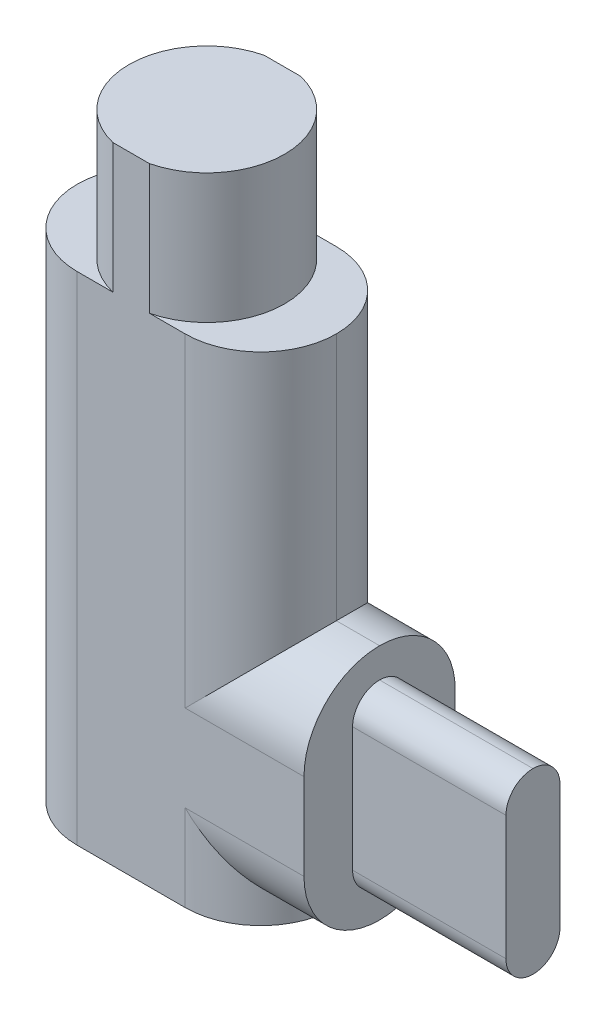
ISO-10303-21;
HEADER;
FILE_DESCRIPTION(('STEP AP214'),'2;1');
FILE_NAME('part.step','',(''),(''),'','','');
FILE_SCHEMA(('AUTOMOTIVE_DESIGN { 1 0 10303 214 1 1 1 1 }'));
ENDSEC;
DATA;
#1=APPLICATION_CONTEXT('core data for automotive mechanical design processes');
#2=APPLICATION_PROTOCOL_DEFINITION('international standard','automotive_design',2000,#1);
#3=PRODUCT_CONTEXT('',#1,'mechanical');
#4=PRODUCT('Part','Part','',(#3));
#5=PRODUCT_RELATED_PRODUCT_CATEGORY('part','',(#4));
#6=PRODUCT_DEFINITION_FORMATION('','',#4);
#7=PRODUCT_DEFINITION_CONTEXT('part definition',#1,'design');
#8=PRODUCT_DEFINITION('design','',#6,#7);
#9=PRODUCT_DEFINITION_SHAPE('','',#8);
#10=(LENGTH_UNIT() NAMED_UNIT(*) SI_UNIT(.MILLI.,.METRE.));
#11=(NAMED_UNIT(*) PLANE_ANGLE_UNIT() SI_UNIT($,.RADIAN.));
#12=(NAMED_UNIT(*) SI_UNIT($,.STERADIAN.) SOLID_ANGLE_UNIT());
#13=UNCERTAINTY_MEASURE_WITH_UNIT(LENGTH_MEASURE(1.E-05),#10,'distance_accuracy_value','');
#14=(GEOMETRIC_REPRESENTATION_CONTEXT(3) GLOBAL_UNCERTAINTY_ASSIGNED_CONTEXT((#13)) GLOBAL_UNIT_ASSIGNED_CONTEXT((#10,
#11,#12)) REPRESENTATION_CONTEXT('',''));
#15=CARTESIAN_POINT('',(0.,0.,0.));
#16=DIRECTION('',(0.,0.,1.));
#17=DIRECTION('',(1.,0.,0.));
#18=AXIS2_PLACEMENT_3D('',#15,#16,#17);
#19=CARTESIAN_POINT('',(-6.002,-142.5,0.));
#20=DIRECTION('',(1.,0.,0.));
#21=DIRECTION('',(0.,0.,-1.));
#22=AXIS2_PLACEMENT_3D('',#19,#20,#21);
#23=CYLINDRICAL_SURFACE('',#22,3.5);
#24=CARTESIAN_POINT('',(2.5,-142.5,-3.5));
#25=CARTESIAN_POINT('',(4.55025253169417,-144.550252531694,-3.5));
#26=CARTESIAN_POINT('',(6.,-146.,-2.05025253169417));
#27=CARTESIAN_POINT('',(6.,-146.,0.));
#28=(BOUNDED_CURVE() B_SPLINE_CURVE(3,(#24,#25,#26,#27),.UNSPECIFIED.,.F.,
.F.) B_SPLINE_CURVE_WITH_KNOTS((4,4),(4.71238898038469,6.28318530717959),
.UNSPECIFIED.) CURVE() GEOMETRIC_REPRESENTATION_ITEM() RATIONAL_B_SPLINE_CURVE((1.,
0.804737854124365,0.804737854124365,1.)) REPRESENTATION_ITEM(''));
#29=CARTESIAN_POINT('',(2.5,-142.5,-3.5));
#30=VERTEX_POINT('',#29);
#31=CARTESIAN_POINT('',(6.,-146.,0.));
#32=VERTEX_POINT('',#31);
#33=EDGE_CURVE('P0_E180',#30,#32,#28,.T.);
#34=ORIENTED_EDGE('',*,*,#33,.F.);
#35=DIRECTION('',(-1.,0.,0.));
#36=VECTOR('',#35,1.);
#37=CARTESIAN_POINT('',(0.,-142.5,-3.5));
#38=LINE('',#37,#36);
#39=CARTESIAN_POINT('',(8.,-142.5,-3.5));
#40=VERTEX_POINT('',#39);
#41=EDGE_CURVE('P0_E178',#40,#30,#38,.T.);
#42=ORIENTED_EDGE('',*,*,#41,.F.);
#43=CARTESIAN_POINT('',(8.,-142.5,0.));
#44=DIRECTION('',(1.,0.,0.));
#45=DIRECTION('',(0.,0.,1.));
#46=AXIS2_PLACEMENT_3D('',#43,#44,#45);
#47=CIRCLE('',#46,3.5);
#48=CARTESIAN_POINT('',(8.,-146.,0.));
#49=VERTEX_POINT('',#48);
#50=EDGE_CURVE('P0_E164',#49,#40,#47,.T.);
#51=ORIENTED_EDGE('',*,*,#50,.F.);
#52=DIRECTION('',(-1.,0.,0.));
#53=VECTOR('',#52,1.);
#54=CARTESIAN_POINT('',(2.5,-146.,0.));
#55=LINE('',#54,#53);
#56=EDGE_CURVE('P0_E11',#49,#32,#55,.T.);
#57=ORIENTED_EDGE('',*,*,#56,.T.);
#58=EDGE_LOOP('',(#34,#42,#51,#57));
#59=FACE_BOUND('',#58,.T.);
#60=ADVANCED_FACE('P0_F16',(#59),#23,.T.);
#61=CARTESIAN_POINT('',(0.,-142.5,0.));
#62=DIRECTION('',(-1.,0.,0.));
#63=DIRECTION('',(0.,0.,1.));
#64=AXIS2_PLACEMENT_3D('',#61,#62,#63);
#65=CYLINDRICAL_SURFACE('',#64,3.5);
#66=DIRECTION('',(1.,0.,0.));
#67=VECTOR('',#66,1.);
#68=CARTESIAN_POINT('',(8.,-142.5,3.5));
#69=LINE('',#68,#67);
#70=CARTESIAN_POINT('',(2.5,-142.5,3.5));
#71=VERTEX_POINT('',#70);
#72=CARTESIAN_POINT('',(8.,-142.5,3.5));
#73=VERTEX_POINT('',#72);
#74=EDGE_CURVE('P0_E239',#71,#73,#69,.T.);
#75=ORIENTED_EDGE('',*,*,#74,.F.);
#76=CARTESIAN_POINT('',(6.,-146.,0.));
#77=CARTESIAN_POINT('',(6.,-146.,2.05025253169417));
#78=CARTESIAN_POINT('',(4.55025253169417,-144.550252531694,3.5));
#79=CARTESIAN_POINT('',(2.5,-142.5,3.5));
#80=(BOUNDED_CURVE() B_SPLINE_CURVE(3,(#76,#77,#78,#79),.UNSPECIFIED.,.F.,
.F.) B_SPLINE_CURVE_WITH_KNOTS((4,4),(3.1415926535898,4.71238898038469),
.UNSPECIFIED.) CURVE() GEOMETRIC_REPRESENTATION_ITEM() RATIONAL_B_SPLINE_CURVE((1.,
0.804737854124365,0.804737854124365,1.)) REPRESENTATION_ITEM(''));
#81=EDGE_CURVE('P0_E20',#32,#71,#80,.T.);
#82=ORIENTED_EDGE('',*,*,#81,.F.);
#83=ORIENTED_EDGE('',*,*,#56,.F.);
#84=CARTESIAN_POINT('',(8.,-142.5,0.));
#85=DIRECTION('',(1.,0.,0.));
#86=DIRECTION('',(0.,0.,1.));
#87=AXIS2_PLACEMENT_3D('',#84,#85,#86);
#88=CIRCLE('',#87,3.5);
#89=EDGE_CURVE('P0_E172',#73,#49,#88,.T.);
#90=ORIENTED_EDGE('',*,*,#89,.F.);
#91=EDGE_LOOP('',(#75,#82,#83,#90));
#92=FACE_BOUND('',#91,.T.);
#93=ADVANCED_FACE('P0_F378',(#92),#65,.T.);
#94=CARTESIAN_POINT('',(0.,-138.5,0.));
#95=DIRECTION('',(1.,0.,0.));
#96=DIRECTION('',(0.,0.,-1.));
#97=AXIS2_PLACEMENT_3D('',#94,#95,#96);
#98=CYLINDRICAL_SURFACE('',#97,3.5);
#99=CARTESIAN_POINT('',(6.,-135.,0.));
#100=CARTESIAN_POINT('',(6.,-135.,-2.05025253169417));
#101=CARTESIAN_POINT('',(4.55025253169417,-136.449747468306,-3.5));
#102=CARTESIAN_POINT('',(2.5,-138.5,-3.5));
#103=(BOUNDED_CURVE() B_SPLINE_CURVE(3,(#99,#100,#101,#102),.UNSPECIFIED.,.F.,
.F.) B_SPLINE_CURVE_WITH_KNOTS((4,4),(0.,1.5707963267949),
.UNSPECIFIED.) CURVE() GEOMETRIC_REPRESENTATION_ITEM() RATIONAL_B_SPLINE_CURVE((1.,
0.804737854124365,0.804737854124365,1.)) REPRESENTATION_ITEM(''));
#104=CARTESIAN_POINT('',(6.,-135.,0.));
#105=VERTEX_POINT('',#104);
#106=CARTESIAN_POINT('',(2.5,-138.5,-3.5));
#107=VERTEX_POINT('',#106);
#108=EDGE_CURVE('P0_E269',#105,#107,#103,.T.);
#109=ORIENTED_EDGE('',*,*,#108,.F.);
#110=DIRECTION('',(1.,0.,0.));
#111=VECTOR('',#110,1.);
#112=CARTESIAN_POINT('',(8.,-135.,0.));
#113=LINE('',#112,#111);
#114=CARTESIAN_POINT('',(8.,-135.,0.));
#115=VERTEX_POINT('',#114);
#116=EDGE_CURVE('P0_E29',#105,#115,#113,.T.);
#117=ORIENTED_EDGE('',*,*,#116,.T.);
#118=CARTESIAN_POINT('',(8.,-138.5,0.));
#119=DIRECTION('',(1.,0.,0.));
#120=DIRECTION('',(0.,0.,1.));
#121=AXIS2_PLACEMENT_3D('',#118,#119,#120);
#122=CIRCLE('',#121,3.5);
#123=CARTESIAN_POINT('',(8.,-138.5,-3.5));
#124=VERTEX_POINT('',#123);
#125=EDGE_CURVE('P0_E175',#124,#115,#122,.T.);
#126=ORIENTED_EDGE('',*,*,#125,.F.);
#127=DIRECTION('',(1.,0.,0.));
#128=VECTOR('',#127,1.);
#129=CARTESIAN_POINT('',(0.,-138.5,-3.5));
#130=LINE('',#129,#128);
#131=EDGE_CURVE('P0_E189',#107,#124,#130,.T.);
#132=ORIENTED_EDGE('',*,*,#131,.F.);
#133=EDGE_LOOP('',(#109,#117,#126,#132));
#134=FACE_BOUND('',#133,.T.);
#135=ADVANCED_FACE('P0_F414',(#134),#98,.T.);
#136=CARTESIAN_POINT('',(-6.002,-138.5,0.));
#137=DIRECTION('',(-1.,0.,0.));
#138=DIRECTION('',(0.,0.,1.));
#139=AXIS2_PLACEMENT_3D('',#136,#137,#138);
#140=CYLINDRICAL_SURFACE('',#139,3.5);
#141=ORIENTED_EDGE('',*,*,#116,.F.);
#142=CARTESIAN_POINT('',(2.5,-138.5,3.5));
#143=CARTESIAN_POINT('',(4.55025253169417,-136.449747468306,3.5));
#144=CARTESIAN_POINT('',(6.,-135.,2.05025253169417));
#145=CARTESIAN_POINT('',(6.,-135.,0.));
#146=(BOUNDED_CURVE() B_SPLINE_CURVE(3,(#142,#143,#144,#145),.UNSPECIFIED.,.F.,
.F.) B_SPLINE_CURVE_WITH_KNOTS((4,4),(1.5707963267949,3.1415926535898),
.UNSPECIFIED.) CURVE() GEOMETRIC_REPRESENTATION_ITEM() RATIONAL_B_SPLINE_CURVE((1.,
0.804737854124365,0.804737854124365,1.)) REPRESENTATION_ITEM(''));
#147=CARTESIAN_POINT('',(2.5,-138.5,3.5));
#148=VERTEX_POINT('',#147);
#149=EDGE_CURVE('P0_E224',#148,#105,#146,.T.);
#150=ORIENTED_EDGE('',*,*,#149,.F.);
#151=DIRECTION('',(-1.,0.,0.));
#152=VECTOR('',#151,1.);
#153=CARTESIAN_POINT('',(2.5,-138.5,3.5));
#154=LINE('',#153,#152);
#155=CARTESIAN_POINT('',(8.,-138.5,3.5));
#156=VERTEX_POINT('',#155);
#157=EDGE_CURVE('P0_E319',#156,#148,#154,.T.);
#158=ORIENTED_EDGE('',*,*,#157,.F.);
#159=CARTESIAN_POINT('',(8.,-138.5,0.));
#160=DIRECTION('',(1.,0.,0.));
#161=DIRECTION('',(0.,0.,1.));
#162=AXIS2_PLACEMENT_3D('',#159,#160,#161);
#163=CIRCLE('',#162,3.5);
#164=EDGE_CURVE('P0_E221',#115,#156,#163,.T.);
#165=ORIENTED_EDGE('',*,*,#164,.F.);
#166=EDGE_LOOP('',(#141,#150,#158,#165));
#167=FACE_BOUND('',#166,.T.);
#168=ADVANCED_FACE('P0_F444',(#167),#140,.T.);
#169=CARTESIAN_POINT('',(8.,0.,0.));
#170=DIRECTION('',(-1.,0.,0.));
#171=DIRECTION('',(0.,0.,1.));
#172=AXIS2_PLACEMENT_3D('',#169,#170,#171);
#173=PLANE('',#172);
#174=ORIENTED_EDGE('',*,*,#89,.T.);
#175=ORIENTED_EDGE('',*,*,#50,.T.);
#176=DIRECTION('',(0.,1.,0.));
#177=VECTOR('',#176,1.);
#178=CARTESIAN_POINT('',(8.,-135.,-3.5));
#179=LINE('',#178,#177);
#180=EDGE_CURVE('P0_E169',#40,#124,#179,.T.);
#181=ORIENTED_EDGE('',*,*,#180,.T.);
#182=ORIENTED_EDGE('',*,*,#125,.T.);
#183=ORIENTED_EDGE('',*,*,#164,.T.);
#184=DIRECTION('',(0.,-1.,0.));
#185=VECTOR('',#184,1.);
#186=CARTESIAN_POINT('',(8.,-146.,3.5));
#187=LINE('',#186,#185);
#188=EDGE_CURVE('P0_E200',#156,#73,#187,.T.);
#189=ORIENTED_EDGE('',*,*,#188,.T.);
#190=EDGE_LOOP('',(#174,#175,#181,#182,#183,#189));
#191=FACE_BOUND('',#190,.T.);
#192=ADVANCED_FACE('P0_F166',(#191),#173,.F.);
#193=CARTESIAN_POINT('',(0.,-123.5,0.));
#194=DIRECTION('',(0.,1.,0.));
#195=DIRECTION('',(1.,0.,0.));
#196=AXIS2_PLACEMENT_3D('',#193,#194,#195);
#197=PLANE('',#196);
#198=DIRECTION('',(1.,0.,0.));
#199=VECTOR('',#198,1.);
#200=CARTESIAN_POINT('',(0.,-123.5,3.5));
#201=LINE('',#200,#199);
#202=CARTESIAN_POINT('',(-2.5,-123.5,3.5));
#203=VERTEX_POINT('',#202);
#204=CARTESIAN_POINT('',(-0.842614977317635,-123.5,3.5));
#205=VERTEX_POINT('',#204);
#206=EDGE_CURVE('P0_E244',#203,#205,#201,.T.);
#207=ORIENTED_EDGE('',*,*,#206,.T.);
#208=CARTESIAN_POINT('',(0.,-123.5,0.));
#209=DIRECTION('',(0.,1.,0.));
#210=DIRECTION('',(0.,0.,1.));
#211=AXIS2_PLACEMENT_3D('',#208,#209,#210);
#212=CIRCLE('',#211,3.6);
#213=CARTESIAN_POINT('',(-0.842614977317635,-123.5,-3.5));
#214=VERTEX_POINT('',#213);
#215=EDGE_CURVE('P0_E296',#214,#205,#212,.T.);
#216=ORIENTED_EDGE('',*,*,#215,.F.);
#217=DIRECTION('',(1.,0.,0.));
#218=VECTOR('',#217,1.);
#219=CARTESIAN_POINT('',(0.,-123.5,-3.5));
#220=LINE('',#219,#218);
#221=CARTESIAN_POINT('',(-2.5,-123.5,-3.5));
#222=VERTEX_POINT('',#221);
#223=EDGE_CURVE('P0_E207',#222,#214,#220,.T.);
#224=ORIENTED_EDGE('',*,*,#223,.F.);
#225=CARTESIAN_POINT('',(-2.5,-123.5,0.));
#226=DIRECTION('',(0.,-1.,0.));
#227=DIRECTION('',(0.,0.,1.));
#228=AXIS2_PLACEMENT_3D('',#225,#226,#227);
#229=CIRCLE('',#228,3.5);
#230=CARTESIAN_POINT('',(-6.,-123.5,0.));
#231=VERTEX_POINT('',#230);
#232=EDGE_CURVE('P0_E216',#231,#222,#229,.T.);
#233=ORIENTED_EDGE('',*,*,#232,.F.);
#234=CARTESIAN_POINT('',(-2.5,-123.5,0.));
#235=DIRECTION('',(0.,-1.,0.));
#236=DIRECTION('',(0.,0.,1.));
#237=AXIS2_PLACEMENT_3D('',#234,#235,#236);
#238=CIRCLE('',#237,3.5);
#239=EDGE_CURVE('P0_E281',#203,#231,#238,.T.);
#240=ORIENTED_EDGE('',*,*,#239,.F.);
#241=EDGE_LOOP('',(#207,#216,#224,#233,#240));
#242=FACE_BOUND('',#241,.T.);
#243=ADVANCED_FACE('P0_F443',(#242),#197,.T.);
#244=CARTESIAN_POINT('',(0.,-123.5,0.));
#245=DIRECTION('',(0.,1.,0.));
#246=DIRECTION('',(0.,0.,1.));
#247=AXIS2_PLACEMENT_3D('',#244,#245,#246);
#248=CYLINDRICAL_SURFACE('',#247,3.6);
#249=DIRECTION('',(0.,1.,0.));
#250=VECTOR('',#249,1.);
#251=CARTESIAN_POINT('',(-0.842614977317635,-123.5,3.5));
#252=LINE('',#251,#250);
#253=CARTESIAN_POINT('',(-0.842614977317635,-117.5,3.5));
#254=VERTEX_POINT('',#253);
#255=EDGE_CURVE('P0_E241',#205,#254,#252,.T.);
#256=ORIENTED_EDGE('',*,*,#255,.T.);
#257=CARTESIAN_POINT('',(0.,-117.5,0.));
#258=DIRECTION('',(0.,1.,0.));
#259=DIRECTION('',(0.,0.,1.));
#260=AXIS2_PLACEMENT_3D('',#257,#258,#259);
#261=CIRCLE('',#260,3.6);
#262=CARTESIAN_POINT('',(-0.842614977317635,-117.5,-3.5));
#263=VERTEX_POINT('',#262);
#264=EDGE_CURVE('P0_E394',#263,#254,#261,.T.);
#265=ORIENTED_EDGE('',*,*,#264,.F.);
#266=DIRECTION('',(0.,1.,0.));
#267=VECTOR('',#266,1.);
#268=CARTESIAN_POINT('',(-0.842614977317635,-123.5,-3.5));
#269=LINE('',#268,#267);
#270=EDGE_CURVE('P0_E206',#214,#263,#269,.T.);
#271=ORIENTED_EDGE('',*,*,#270,.F.);
#272=ORIENTED_EDGE('',*,*,#215,.T.);
#273=EDGE_LOOP('',(#256,#265,#271,#272));
#274=FACE_BOUND('',#273,.T.);
#275=ADVANCED_FACE('P0_F665',(#274),#248,.T.);
#276=CARTESIAN_POINT('',(0.,-123.5,0.));
#277=DIRECTION('',(0.,1.,0.));
#278=DIRECTION('',(0.,0.,1.));
#279=AXIS2_PLACEMENT_3D('',#276,#277,#278);
#280=CYLINDRICAL_SURFACE('',#279,3.6);
#281=DIRECTION('',(0.,-1.,0.));
#282=VECTOR('',#281,1.);
#283=CARTESIAN_POINT('',(0.842614977317635,-123.5,3.5));
#284=LINE('',#283,#282);
#285=CARTESIAN_POINT('',(0.842614977317635,-117.5,3.5));
#286=VERTEX_POINT('',#285);
#287=CARTESIAN_POINT('',(0.842614977317635,-123.5,3.5));
#288=VERTEX_POINT('',#287);
#289=EDGE_CURVE('P0_E245',#286,#288,#284,.T.);
#290=ORIENTED_EDGE('',*,*,#289,.T.);
#291=CARTESIAN_POINT('',(0.,-123.5,0.));
#292=DIRECTION('',(0.,1.,0.));
#293=DIRECTION('',(0.,0.,1.));
#294=AXIS2_PLACEMENT_3D('',#291,#292,#293);
#295=CIRCLE('',#294,3.6);
#296=CARTESIAN_POINT('',(0.842614977317635,-123.5,-3.5));
#297=VERTEX_POINT('',#296);
#298=EDGE_CURVE('P0_E259',#288,#297,#295,.T.);
#299=ORIENTED_EDGE('',*,*,#298,.T.);
#300=DIRECTION('',(0.,-1.,0.));
#301=VECTOR('',#300,1.);
#302=CARTESIAN_POINT('',(0.842614977317635,-123.5,-3.5));
#303=LINE('',#302,#301);
#304=CARTESIAN_POINT('',(0.842614977317635,-117.5,-3.5));
#305=VERTEX_POINT('',#304);
#306=EDGE_CURVE('P0_E201',#305,#297,#303,.T.);
#307=ORIENTED_EDGE('',*,*,#306,.F.);
#308=CARTESIAN_POINT('',(0.,-117.5,0.));
#309=DIRECTION('',(0.,1.,0.));
#310=DIRECTION('',(0.,0.,1.));
#311=AXIS2_PLACEMENT_3D('',#308,#309,#310);
#312=CIRCLE('',#311,3.6);
#313=EDGE_CURVE('P0_E260',#286,#305,#312,.T.);
#314=ORIENTED_EDGE('',*,*,#313,.F.);
#315=EDGE_LOOP('',(#290,#299,#307,#314));
#316=FACE_BOUND('',#315,.T.);
#317=ADVANCED_FACE('P0_F453',(#316),#280,.T.);
#318=CARTESIAN_POINT('',(0.,-123.5,0.));
#319=DIRECTION('',(0.,1.,0.));
#320=DIRECTION('',(1.,0.,0.));
#321=AXIS2_PLACEMENT_3D('',#318,#319,#320);
#322=PLANE('',#321);
#323=DIRECTION('',(1.,0.,0.));
#324=VECTOR('',#323,1.);
#325=CARTESIAN_POINT('',(0.,-123.5,3.5));
#326=LINE('',#325,#324);
#327=CARTESIAN_POINT('',(2.5,-123.5,3.5));
#328=VERTEX_POINT('',#327);
#329=EDGE_CURVE('P0_E322',#288,#328,#326,.T.);
#330=ORIENTED_EDGE('',*,*,#329,.T.);
#331=CARTESIAN_POINT('',(2.5,-123.5,0.));
#332=DIRECTION('',(0.,-1.,0.));
#333=DIRECTION('',(0.,0.,1.));
#334=AXIS2_PLACEMENT_3D('',#331,#332,#333);
#335=CIRCLE('',#334,3.5);
#336=CARTESIAN_POINT('',(6.,-123.5,0.));
#337=VERTEX_POINT('',#336);
#338=EDGE_CURVE('P0_E288',#337,#328,#335,.T.);
#339=ORIENTED_EDGE('',*,*,#338,.F.);
#340=CARTESIAN_POINT('',(2.5,-123.5,0.));
#341=DIRECTION('',(0.,-1.,0.));
#342=DIRECTION('',(0.,0.,1.));
#343=AXIS2_PLACEMENT_3D('',#340,#341,#342);
#344=CIRCLE('',#343,3.5);
#345=CARTESIAN_POINT('',(2.5,-123.5,-3.5));
#346=VERTEX_POINT('',#345);
#347=EDGE_CURVE('P0_E265',#346,#337,#344,.T.);
#348=ORIENTED_EDGE('',*,*,#347,.F.);
#349=DIRECTION('',(1.,0.,0.));
#350=VECTOR('',#349,1.);
#351=CARTESIAN_POINT('',(0.,-123.5,-3.5));
#352=LINE('',#351,#350);
#353=EDGE_CURVE('P0_E205',#297,#346,#352,.T.);
#354=ORIENTED_EDGE('',*,*,#353,.F.);
#355=ORIENTED_EDGE('',*,*,#298,.F.);
#356=EDGE_LOOP('',(#330,#339,#348,#354,#355));
#357=FACE_BOUND('',#356,.T.);
#358=ADVANCED_FACE('P0_F449',(#357),#322,.T.);
#359=CARTESIAN_POINT('',(6.,-146.5,3.5));
#360=DIRECTION('',(0.,1.,0.));
#361=DIRECTION('',(1.,0.,0.));
#362=AXIS2_PLACEMENT_3D('',#359,#360,#361);
#363=PLANE('',#362);
#364=DIRECTION('',(1.,0.,0.));
#365=VECTOR('',#364,1.);
#366=CARTESIAN_POINT('',(6.,-146.5,3.5));
#367=LINE('',#366,#365);
#368=CARTESIAN_POINT('',(-2.5,-146.5,3.5));
#369=VERTEX_POINT('',#368);
#370=CARTESIAN_POINT('',(2.5,-146.5,3.5));
#371=VERTEX_POINT('',#370);
#372=EDGE_CURVE('P0_E196',#369,#371,#367,.T.);
#373=ORIENTED_EDGE('',*,*,#372,.F.);
#374=CARTESIAN_POINT('',(-2.5,-146.5,0.));
#375=DIRECTION('',(0.,-1.,0.));
#376=DIRECTION('',(0.,0.,1.));
#377=AXIS2_PLACEMENT_3D('',#374,#375,#376);
#378=CIRCLE('',#377,3.5);
#379=CARTESIAN_POINT('',(-6.,-146.5,0.));
#380=VERTEX_POINT('',#379);
#381=EDGE_CURVE('P0_E278',#369,#380,#378,.T.);
#382=ORIENTED_EDGE('',*,*,#381,.T.);
#383=CARTESIAN_POINT('',(-2.5,-146.5,0.));
#384=DIRECTION('',(0.,-1.,0.));
#385=DIRECTION('',(0.,0.,1.));
#386=AXIS2_PLACEMENT_3D('',#383,#384,#385);
#387=CIRCLE('',#386,3.5);
#388=CARTESIAN_POINT('',(-2.5,-146.5,-3.5));
#389=VERTEX_POINT('',#388);
#390=EDGE_CURVE('P0_E219',#380,#389,#387,.T.);
#391=ORIENTED_EDGE('',*,*,#390,.T.);
#392=DIRECTION('',(1.,0.,0.));
#393=VECTOR('',#392,1.);
#394=CARTESIAN_POINT('',(6.,-146.5,-3.5));
#395=LINE('',#394,#393);
#396=CARTESIAN_POINT('',(2.5,-146.5,-3.5));
#397=VERTEX_POINT('',#396);
#398=EDGE_CURVE('P0_E214',#389,#397,#395,.T.);
#399=ORIENTED_EDGE('',*,*,#398,.T.);
#400=CARTESIAN_POINT('',(2.5,-146.5,0.));
#401=DIRECTION('',(0.,-1.,0.));
#402=DIRECTION('',(0.,0.,1.));
#403=AXIS2_PLACEMENT_3D('',#400,#401,#402);
#404=CIRCLE('',#403,3.5);
#405=CARTESIAN_POINT('',(6.,-146.5,0.));
#406=VERTEX_POINT('',#405);
#407=EDGE_CURVE('P0_E250',#397,#406,#404,.T.);
#408=ORIENTED_EDGE('',*,*,#407,.T.);
#409=CARTESIAN_POINT('',(2.5,-146.5,0.));
#410=DIRECTION('',(0.,-1.,0.));
#411=DIRECTION('',(0.,0.,1.));
#412=AXIS2_PLACEMENT_3D('',#409,#410,#411);
#413=CIRCLE('',#412,3.5);
#414=EDGE_CURVE('P0_E251',#406,#371,#413,.T.);
#415=ORIENTED_EDGE('',*,*,#414,.T.);
#416=EDGE_LOOP('',(#373,#382,#391,#399,#408,#415));
#417=FACE_BOUND('',#416,.T.);
#418=ADVANCED_FACE('P0_F452',(#417),#363,.F.);
#419=CARTESIAN_POINT('',(2.5,-117.5,0.));
#420=DIRECTION('',(0.,-1.,0.));
#421=DIRECTION('',(0.,0.,-1.));
#422=AXIS2_PLACEMENT_3D('',#419,#420,#421);
#423=CYLINDRICAL_SURFACE('',#422,3.5);
#424=DIRECTION('',(0.,-1.,0.));
#425=VECTOR('',#424,1.);
#426=CARTESIAN_POINT('',(2.5,-146.5,-3.5));
#427=LINE('',#426,#425);
#428=EDGE_CURVE('P0_E185',#30,#397,#427,.T.);
#429=ORIENTED_EDGE('',*,*,#428,.F.);
#430=ORIENTED_EDGE('',*,*,#33,.T.);
#431=DIRECTION('',(0.,-1.,0.));
#432=VECTOR('',#431,1.);
#433=CARTESIAN_POINT('',(6.,-117.5,0.));
#434=LINE('',#433,#432);
#435=EDGE_CURVE('P0_E280',#32,#406,#434,.T.);
#436=ORIENTED_EDGE('',*,*,#435,.T.);
#437=ORIENTED_EDGE('',*,*,#407,.F.);
#438=EDGE_LOOP('',(#429,#430,#436,#437));
#439=FACE_BOUND('',#438,.T.);
#440=ADVANCED_FACE('P0_F436',(#439),#423,.T.);
#441=CARTESIAN_POINT('',(2.5,0.,0.));
#442=DIRECTION('',(0.,1.,0.));
#443=DIRECTION('',(0.,0.,1.));
#444=AXIS2_PLACEMENT_3D('',#441,#442,#443);
#445=CYLINDRICAL_SURFACE('',#444,3.5);
#446=ORIENTED_EDGE('',*,*,#435,.F.);
#447=ORIENTED_EDGE('',*,*,#81,.T.);
#448=DIRECTION('',(0.,1.,0.));
#449=VECTOR('',#448,1.);
#450=CARTESIAN_POINT('',(2.5,0.,3.5));
#451=LINE('',#450,#449);
#452=EDGE_CURVE('P0_E232',#371,#71,#451,.T.);
#453=ORIENTED_EDGE('',*,*,#452,.F.);
#454=ORIENTED_EDGE('',*,*,#414,.F.);
#455=EDGE_LOOP('',(#446,#447,#453,#454));
#456=FACE_BOUND('',#455,.T.);
#457=ADVANCED_FACE('P0_F375',(#456),#445,.T.);
#458=CARTESIAN_POINT('',(-2.5,0.,0.));
#459=DIRECTION('',(0.,-1.,0.));
#460=DIRECTION('',(0.,0.,-1.));
#461=AXIS2_PLACEMENT_3D('',#458,#459,#460);
#462=CYLINDRICAL_SURFACE('',#461,3.5);
#463=DIRECTION('',(0.,-1.,0.));
#464=VECTOR('',#463,1.);
#465=CARTESIAN_POINT('',(-2.5,0.,3.5));
#466=LINE('',#465,#464);
#467=EDGE_CURVE('P0_E333',#203,#369,#466,.T.);
#468=ORIENTED_EDGE('',*,*,#467,.F.);
#469=ORIENTED_EDGE('',*,*,#239,.T.);
#470=DIRECTION('',(0.,-1.,0.));
#471=VECTOR('',#470,1.);
#472=CARTESIAN_POINT('',(-6.,-146.5,0.));
#473=LINE('',#472,#471);
#474=EDGE_CURVE('P0_E220',#231,#380,#473,.T.);
#475=ORIENTED_EDGE('',*,*,#474,.T.);
#476=ORIENTED_EDGE('',*,*,#381,.F.);
#477=EDGE_LOOP('',(#468,#469,#475,#476));
#478=FACE_BOUND('',#477,.T.);
#479=ADVANCED_FACE('P0_F345',(#478),#462,.T.);
#480=CARTESIAN_POINT('',(-2.5,-146.5,0.));
#481=DIRECTION('',(0.,1.,0.));
#482=DIRECTION('',(0.,0.,1.));
#483=AXIS2_PLACEMENT_3D('',#480,#481,#482);
#484=CYLINDRICAL_SURFACE('',#483,3.5);
#485=ORIENTED_EDGE('',*,*,#474,.F.);
#486=ORIENTED_EDGE('',*,*,#232,.T.);
#487=DIRECTION('',(0.,1.,0.));
#488=VECTOR('',#487,1.);
#489=CARTESIAN_POINT('',(-2.5,-117.5,-3.5));
#490=LINE('',#489,#488);
#491=EDGE_CURVE('P0_E210',#389,#222,#490,.T.);
#492=ORIENTED_EDGE('',*,*,#491,.F.);
#493=ORIENTED_EDGE('',*,*,#390,.F.);
#494=EDGE_LOOP('',(#485,#486,#492,#493));
#495=FACE_BOUND('',#494,.T.);
#496=ADVANCED_FACE('P0_F350',(#495),#484,.T.);
#497=CARTESIAN_POINT('',(0.,0.,-3.5));
#498=DIRECTION('',(0.,0.,-1.));
#499=DIRECTION('',(0.,-1.,0.));
#500=AXIS2_PLACEMENT_3D('',#497,#498,#499);
#501=PLANE('',#500);
#502=DIRECTION('',(0.,-1.,0.));
#503=VECTOR('',#502,1.);
#504=CARTESIAN_POINT('',(2.5,-146.5,-3.5));
#505=LINE('',#504,#503);
#506=EDGE_CURVE('P0_E266',#346,#107,#505,.T.);
#507=ORIENTED_EDGE('',*,*,#506,.T.);
#508=ORIENTED_EDGE('',*,*,#131,.T.);
#509=ORIENTED_EDGE('',*,*,#180,.F.);
#510=ORIENTED_EDGE('',*,*,#41,.T.);
#511=ORIENTED_EDGE('',*,*,#428,.T.);
#512=ORIENTED_EDGE('',*,*,#398,.F.);
#513=ORIENTED_EDGE('',*,*,#491,.T.);
#514=ORIENTED_EDGE('',*,*,#223,.T.);
#515=ORIENTED_EDGE('',*,*,#270,.T.);
#516=DIRECTION('',(-1.,0.,0.));
#517=VECTOR('',#516,1.);
#518=CARTESIAN_POINT('',(-6.,-117.5,-3.5));
#519=LINE('',#518,#517);
#520=EDGE_CURVE('P0_E264',#305,#263,#519,.T.);
#521=ORIENTED_EDGE('',*,*,#520,.F.);
#522=ORIENTED_EDGE('',*,*,#306,.T.);
#523=ORIENTED_EDGE('',*,*,#353,.T.);
#524=EDGE_LOOP('',(#507,#508,#509,#510,#511,#512,#513,#514,#515,#521,#522,#523));
#525=FACE_BOUND('',#524,.T.);
#526=ADVANCED_FACE('P0_F188',(#525),#501,.T.);
#527=CARTESIAN_POINT('',(0.,0.,3.5));
#528=DIRECTION('',(0.,0.,-1.));
#529=DIRECTION('',(0.,-1.,0.));
#530=AXIS2_PLACEMENT_3D('',#527,#528,#529);
#531=PLANE('',#530);
#532=ORIENTED_EDGE('',*,*,#452,.T.);
#533=ORIENTED_EDGE('',*,*,#74,.T.);
#534=ORIENTED_EDGE('',*,*,#188,.F.);
#535=ORIENTED_EDGE('',*,*,#157,.T.);
#536=DIRECTION('',(0.,1.,0.));
#537=VECTOR('',#536,1.);
#538=CARTESIAN_POINT('',(2.5,0.,3.5));
#539=LINE('',#538,#537);
#540=EDGE_CURVE('P0_E231',#148,#328,#539,.T.);
#541=ORIENTED_EDGE('',*,*,#540,.T.);
#542=ORIENTED_EDGE('',*,*,#329,.F.);
#543=ORIENTED_EDGE('',*,*,#289,.F.);
#544=DIRECTION('',(-1.,0.,0.));
#545=VECTOR('',#544,1.);
#546=CARTESIAN_POINT('',(-6.,-117.5,3.5));
#547=LINE('',#546,#545);
#548=EDGE_CURVE('P0_E240',#286,#254,#547,.T.);
#549=ORIENTED_EDGE('',*,*,#548,.T.);
#550=ORIENTED_EDGE('',*,*,#255,.F.);
#551=ORIENTED_EDGE('',*,*,#206,.F.);
#552=ORIENTED_EDGE('',*,*,#467,.T.);
#553=ORIENTED_EDGE('',*,*,#372,.T.);
#554=EDGE_LOOP('',(#532,#533,#534,#535,#541,#542,#543,#549,#550,#551,#552,#553));
#555=FACE_BOUND('',#554,.T.);
#556=ADVANCED_FACE('P0_F382',(#555),#531,.F.);
#557=CARTESIAN_POINT('',(-6.,-117.5,3.5));
#558=DIRECTION('',(0.,-1.,0.));
#559=DIRECTION('',(0.,0.,-1.));
#560=AXIS2_PLACEMENT_3D('',#557,#558,#559);
#561=PLANE('',#560);
#562=ORIENTED_EDGE('',*,*,#313,.T.);
#563=ORIENTED_EDGE('',*,*,#520,.T.);
#564=ORIENTED_EDGE('',*,*,#264,.T.);
#565=ORIENTED_EDGE('',*,*,#548,.F.);
#566=EDGE_LOOP('',(#562,#563,#564,#565));
#567=FACE_BOUND('',#566,.T.);
#568=ADVANCED_FACE('P0_F420',(#567),#561,.F.);
#569=CARTESIAN_POINT('',(2.5,-117.5,0.));
#570=DIRECTION('',(0.,-1.,0.));
#571=DIRECTION('',(0.,0.,-1.));
#572=AXIS2_PLACEMENT_3D('',#569,#570,#571);
#573=CYLINDRICAL_SURFACE('',#572,3.5);
#574=DIRECTION('',(0.,-1.,0.));
#575=VECTOR('',#574,1.);
#576=CARTESIAN_POINT('',(6.,-117.5,0.));
#577=LINE('',#576,#575);
#578=EDGE_CURVE('P0_E230',#337,#105,#577,.T.);
#579=ORIENTED_EDGE('',*,*,#578,.T.);
#580=ORIENTED_EDGE('',*,*,#108,.T.);
#581=ORIENTED_EDGE('',*,*,#506,.F.);
#582=ORIENTED_EDGE('',*,*,#347,.T.);
#583=EDGE_LOOP('',(#579,#580,#581,#582));
#584=FACE_BOUND('',#583,.T.);
#585=ADVANCED_FACE('P0_F18',(#584),#573,.T.);
#586=CARTESIAN_POINT('',(2.5,0.,0.));
#587=DIRECTION('',(0.,1.,0.));
#588=DIRECTION('',(0.,0.,1.));
#589=AXIS2_PLACEMENT_3D('',#586,#587,#588);
#590=CYLINDRICAL_SURFACE('',#589,3.5);
#591=ORIENTED_EDGE('',*,*,#540,.F.);
#592=ORIENTED_EDGE('',*,*,#149,.T.);
#593=ORIENTED_EDGE('',*,*,#578,.F.);
#594=ORIENTED_EDGE('',*,*,#338,.T.);
#595=EDGE_LOOP('',(#591,#592,#593,#594));
#596=FACE_BOUND('',#595,.T.);
#597=ADVANCED_FACE('P0_F419',(#596),#590,.T.);
#598=CLOSED_SHELL('',(#60,#93,#135,#168,#192,#243,#275,#317,#358,#418,#440,#457,#479,#496,#526,
#556,#568,#585,#597));
#599=MANIFOLD_SOLID_BREP('P0_B1',#598);
#600=CARTESIAN_POINT('',(15.1,-137.625,0.));
#601=DIRECTION('',(-1.,0.,0.));
#602=DIRECTION('',(0.,0.,1.));
#603=AXIS2_PLACEMENT_3D('',#600,#601,#602);
#604=CYLINDRICAL_SURFACE('',#603,1.25);
#605=CARTESIAN_POINT('',(15.1,-137.625,0.));
#606=DIRECTION('',(1.,0.,0.));
#607=DIRECTION('',(0.,0.,1.));
#608=AXIS2_PLACEMENT_3D('',#605,#606,#607);
#609=CIRCLE('',#608,1.25);
#610=CARTESIAN_POINT('',(15.1,-137.625,-1.25));
#611=VERTEX_POINT('',#610);
#612=CARTESIAN_POINT('',(15.1,-136.375,0.));
#613=VERTEX_POINT('',#612);
#614=EDGE_CURVE('P1_E126',#611,#613,#609,.T.);
#615=ORIENTED_EDGE('',*,*,#614,.F.);
#616=DIRECTION('',(1.,0.,0.));
#617=VECTOR('',#616,1.);
#618=CARTESIAN_POINT('',(15.1,-137.625,-1.25));
#619=LINE('',#618,#617);
#620=CARTESIAN_POINT('',(8.,-137.625,-1.25));
#621=VERTEX_POINT('',#620);
#622=EDGE_CURVE('P1_E102',#621,#611,#619,.T.);
#623=ORIENTED_EDGE('',*,*,#622,.F.);
#624=CARTESIAN_POINT('',(8.,-137.625,0.));
#625=DIRECTION('',(-1.,0.,0.));
#626=DIRECTION('',(0.,0.,1.));
#627=AXIS2_PLACEMENT_3D('',#624,#625,#626);
#628=CIRCLE('',#627,1.25);
#629=CARTESIAN_POINT('',(8.,-136.375,0.));
#630=VERTEX_POINT('',#629);
#631=EDGE_CURVE('P1_E97',#630,#621,#628,.T.);
#632=ORIENTED_EDGE('',*,*,#631,.F.);
#633=DIRECTION('',(1.,0.,0.));
#634=VECTOR('',#633,1.);
#635=CARTESIAN_POINT('',(15.1,-136.375,0.));
#636=LINE('',#635,#634);
#637=EDGE_CURVE('P1_E11',#630,#613,#636,.T.);
#638=ORIENTED_EDGE('',*,*,#637,.T.);
#639=EDGE_LOOP('',(#615,#623,#632,#638));
#640=FACE_BOUND('',#639,.T.);
#641=ADVANCED_FACE('P1_F16',(#640),#604,.T.);
#642=CARTESIAN_POINT('',(15.1,-137.625,0.));
#643=DIRECTION('',(-1.,0.,0.));
#644=DIRECTION('',(0.,0.,1.));
#645=AXIS2_PLACEMENT_3D('',#642,#643,#644);
#646=CYLINDRICAL_SURFACE('',#645,1.25);
#647=DIRECTION('',(-1.,0.,0.));
#648=VECTOR('',#647,1.);
#649=CARTESIAN_POINT('',(15.1,-137.625,1.25));
#650=LINE('',#649,#648);
#651=CARTESIAN_POINT('',(15.1,-137.625,1.25));
#652=VERTEX_POINT('',#651);
#653=CARTESIAN_POINT('',(8.,-137.625,1.25));
#654=VERTEX_POINT('',#653);
#655=EDGE_CURVE('P1_E113',#652,#654,#650,.T.);
#656=ORIENTED_EDGE('',*,*,#655,.F.);
#657=CARTESIAN_POINT('',(15.1,-137.625,0.));
#658=DIRECTION('',(1.,0.,0.));
#659=DIRECTION('',(0.,0.,1.));
#660=AXIS2_PLACEMENT_3D('',#657,#658,#659);
#661=CIRCLE('',#660,1.25);
#662=EDGE_CURVE('P1_E91',#613,#652,#661,.T.);
#663=ORIENTED_EDGE('',*,*,#662,.F.);
#664=ORIENTED_EDGE('',*,*,#637,.F.);
#665=CARTESIAN_POINT('',(8.,-137.625,0.));
#666=DIRECTION('',(-1.,0.,0.));
#667=DIRECTION('',(0.,0.,1.));
#668=AXIS2_PLACEMENT_3D('',#665,#666,#667);
#669=CIRCLE('',#668,1.25);
#670=EDGE_CURVE('P1_E130',#654,#630,#669,.T.);
#671=ORIENTED_EDGE('',*,*,#670,.F.);
#672=EDGE_LOOP('',(#656,#663,#664,#671));
#673=FACE_BOUND('',#672,.T.);
#674=ADVANCED_FACE('P1_F164',(#673),#646,.T.);
#675=CARTESIAN_POINT('',(15.1,-143.375,0.));
#676=DIRECTION('',(-1.,0.,0.));
#677=DIRECTION('',(0.,0.,1.));
#678=AXIS2_PLACEMENT_3D('',#675,#676,#677);
#679=CYLINDRICAL_SURFACE('',#678,1.25);
#680=CARTESIAN_POINT('',(15.1,-143.375,0.));
#681=DIRECTION('',(1.,0.,0.));
#682=DIRECTION('',(0.,0.,1.));
#683=AXIS2_PLACEMENT_3D('',#680,#681,#682);
#684=CIRCLE('',#683,1.25);
#685=CARTESIAN_POINT('',(15.1,-143.375,1.25));
#686=VERTEX_POINT('',#685);
#687=CARTESIAN_POINT('',(15.1,-144.625,0.));
#688=VERTEX_POINT('',#687);
#689=EDGE_CURVE('P1_E116',#686,#688,#684,.T.);
#690=ORIENTED_EDGE('',*,*,#689,.F.);
#691=DIRECTION('',(1.,0.,0.));
#692=VECTOR('',#691,1.);
#693=CARTESIAN_POINT('',(15.1,-143.375,1.25));
#694=LINE('',#693,#692);
#695=CARTESIAN_POINT('',(8.,-143.375,1.25));
#696=VERTEX_POINT('',#695);
#697=EDGE_CURVE('P1_E139',#696,#686,#694,.T.);
#698=ORIENTED_EDGE('',*,*,#697,.F.);
#699=CARTESIAN_POINT('',(8.,-143.375,0.));
#700=DIRECTION('',(-1.,0.,0.));
#701=DIRECTION('',(0.,0.,1.));
#702=AXIS2_PLACEMENT_3D('',#699,#700,#701);
#703=CIRCLE('',#702,1.25);
#704=CARTESIAN_POINT('',(8.,-144.625,0.));
#705=VERTEX_POINT('',#704);
#706=EDGE_CURVE('P1_E90',#705,#696,#703,.T.);
#707=ORIENTED_EDGE('',*,*,#706,.F.);
#708=DIRECTION('',(1.,0.,0.));
#709=VECTOR('',#708,1.);
#710=CARTESIAN_POINT('',(15.1,-144.625,0.));
#711=LINE('',#710,#709);
#712=EDGE_CURVE('P1_E26',#705,#688,#711,.T.);
#713=ORIENTED_EDGE('',*,*,#712,.T.);
#714=EDGE_LOOP('',(#690,#698,#707,#713));
#715=FACE_BOUND('',#714,.T.);
#716=ADVANCED_FACE('P1_F159',(#715),#679,.T.);
#717=CARTESIAN_POINT('',(15.1,-143.375,0.));
#718=DIRECTION('',(-1.,0.,0.));
#719=DIRECTION('',(0.,0.,1.));
#720=AXIS2_PLACEMENT_3D('',#717,#718,#719);
#721=CYLINDRICAL_SURFACE('',#720,1.25);
#722=DIRECTION('',(-1.,0.,0.));
#723=VECTOR('',#722,1.);
#724=CARTESIAN_POINT('',(15.1,-143.375,-1.25));
#725=LINE('',#724,#723);
#726=CARTESIAN_POINT('',(15.1,-143.375,-1.25));
#727=VERTEX_POINT('',#726);
#728=CARTESIAN_POINT('',(8.,-143.375,-1.25));
#729=VERTEX_POINT('',#728);
#730=EDGE_CURVE('P1_E85',#727,#729,#725,.T.);
#731=ORIENTED_EDGE('',*,*,#730,.F.);
#732=CARTESIAN_POINT('',(15.1,-143.375,0.));
#733=DIRECTION('',(1.,0.,0.));
#734=DIRECTION('',(0.,0.,1.));
#735=AXIS2_PLACEMENT_3D('',#732,#733,#734);
#736=CIRCLE('',#735,1.25);
#737=EDGE_CURVE('P1_E120',#688,#727,#736,.T.);
#738=ORIENTED_EDGE('',*,*,#737,.F.);
#739=ORIENTED_EDGE('',*,*,#712,.F.);
#740=CARTESIAN_POINT('',(8.,-143.375,0.));
#741=DIRECTION('',(-1.,0.,0.));
#742=DIRECTION('',(0.,0.,1.));
#743=AXIS2_PLACEMENT_3D('',#740,#741,#742);
#744=CIRCLE('',#743,1.25);
#745=EDGE_CURVE('P1_E80',#729,#705,#744,.T.);
#746=ORIENTED_EDGE('',*,*,#745,.F.);
#747=EDGE_LOOP('',(#731,#738,#739,#746));
#748=FACE_BOUND('',#747,.T.);
#749=ADVANCED_FACE('P1_F82',(#748),#721,.T.);
#750=CARTESIAN_POINT('',(8.,0.,0.));
#751=DIRECTION('',(-1.,0.,0.));
#752=DIRECTION('',(0.,0.,1.));
#753=AXIS2_PLACEMENT_3D('',#750,#751,#752);
#754=PLANE('',#753);
#755=ORIENTED_EDGE('',*,*,#745,.T.);
#756=ORIENTED_EDGE('',*,*,#706,.T.);
#757=DIRECTION('',(0.,-1.,0.));
#758=VECTOR('',#757,1.);
#759=CARTESIAN_POINT('',(8.,-136.375,1.25));
#760=LINE('',#759,#758);
#761=EDGE_CURVE('P1_E136',#654,#696,#760,.T.);
#762=ORIENTED_EDGE('',*,*,#761,.F.);
#763=ORIENTED_EDGE('',*,*,#670,.T.);
#764=ORIENTED_EDGE('',*,*,#631,.T.);
#765=DIRECTION('',(0.,1.,0.));
#766=VECTOR('',#765,1.);
#767=CARTESIAN_POINT('',(8.,-136.375,-1.25));
#768=LINE('',#767,#766);
#769=EDGE_CURVE('P1_E94',#729,#621,#768,.T.);
#770=ORIENTED_EDGE('',*,*,#769,.F.);
#771=EDGE_LOOP('',(#755,#756,#762,#763,#764,#770));
#772=FACE_BOUND('',#771,.T.);
#773=ADVANCED_FACE('P1_F95',(#772),#754,.T.);
#774=CARTESIAN_POINT('',(15.1,0.,0.));
#775=DIRECTION('',(-1.,0.,0.));
#776=DIRECTION('',(0.,0.,1.));
#777=AXIS2_PLACEMENT_3D('',#774,#775,#776);
#778=PLANE('',#777);
#779=DIRECTION('',(0.,-1.,0.));
#780=VECTOR('',#779,1.);
#781=CARTESIAN_POINT('',(15.1,-136.375,1.25));
#782=LINE('',#781,#780);
#783=EDGE_CURVE('P1_E123',#652,#686,#782,.T.);
#784=ORIENTED_EDGE('',*,*,#783,.T.);
#785=ORIENTED_EDGE('',*,*,#689,.T.);
#786=ORIENTED_EDGE('',*,*,#737,.T.);
#787=DIRECTION('',(0.,1.,0.));
#788=VECTOR('',#787,1.);
#789=CARTESIAN_POINT('',(15.1,-136.375,-1.25));
#790=LINE('',#789,#788);
#791=EDGE_CURVE('P1_E106',#727,#611,#790,.T.);
#792=ORIENTED_EDGE('',*,*,#791,.T.);
#793=ORIENTED_EDGE('',*,*,#614,.T.);
#794=ORIENTED_EDGE('',*,*,#662,.T.);
#795=EDGE_LOOP('',(#784,#785,#786,#792,#793,#794));
#796=FACE_BOUND('',#795,.T.);
#797=ADVANCED_FACE('P1_F18',(#796),#778,.F.);
#798=CARTESIAN_POINT('',(15.1,-136.375,-1.25));
#799=DIRECTION('',(0.,0.,1.));
#800=DIRECTION('',(0.,-1.,0.));
#801=AXIS2_PLACEMENT_3D('',#798,#799,#800);
#802=PLANE('',#801);
#803=ORIENTED_EDGE('',*,*,#791,.F.);
#804=ORIENTED_EDGE('',*,*,#730,.T.);
#805=ORIENTED_EDGE('',*,*,#769,.T.);
#806=ORIENTED_EDGE('',*,*,#622,.T.);
#807=EDGE_LOOP('',(#803,#804,#805,#806));
#808=FACE_BOUND('',#807,.T.);
#809=ADVANCED_FACE('P1_F104',(#808),#802,.F.);
#810=CARTESIAN_POINT('',(15.1,-136.375,1.25));
#811=DIRECTION('',(0.,0.,-1.));
#812=DIRECTION('',(-1.,0.,0.));
#813=AXIS2_PLACEMENT_3D('',#810,#811,#812);
#814=PLANE('',#813);
#815=ORIENTED_EDGE('',*,*,#761,.T.);
#816=ORIENTED_EDGE('',*,*,#697,.T.);
#817=ORIENTED_EDGE('',*,*,#783,.F.);
#818=ORIENTED_EDGE('',*,*,#655,.T.);
#819=EDGE_LOOP('',(#815,#816,#817,#818));
#820=FACE_BOUND('',#819,.T.);
#821=ADVANCED_FACE('P1_F162',(#820),#814,.F.);
#822=CLOSED_SHELL('',(#641,#674,#716,#749,#773,#797,#809,#821));
#823=MANIFOLD_SOLID_BREP('P1_B1',#822);
#824=ADVANCED_BREP_SHAPE_REPRESENTATION('',(#18,#599,#823),#14);
#825=SHAPE_DEFINITION_REPRESENTATION(#9,#824);
ENDSEC;
END-ISO-10303-21;
